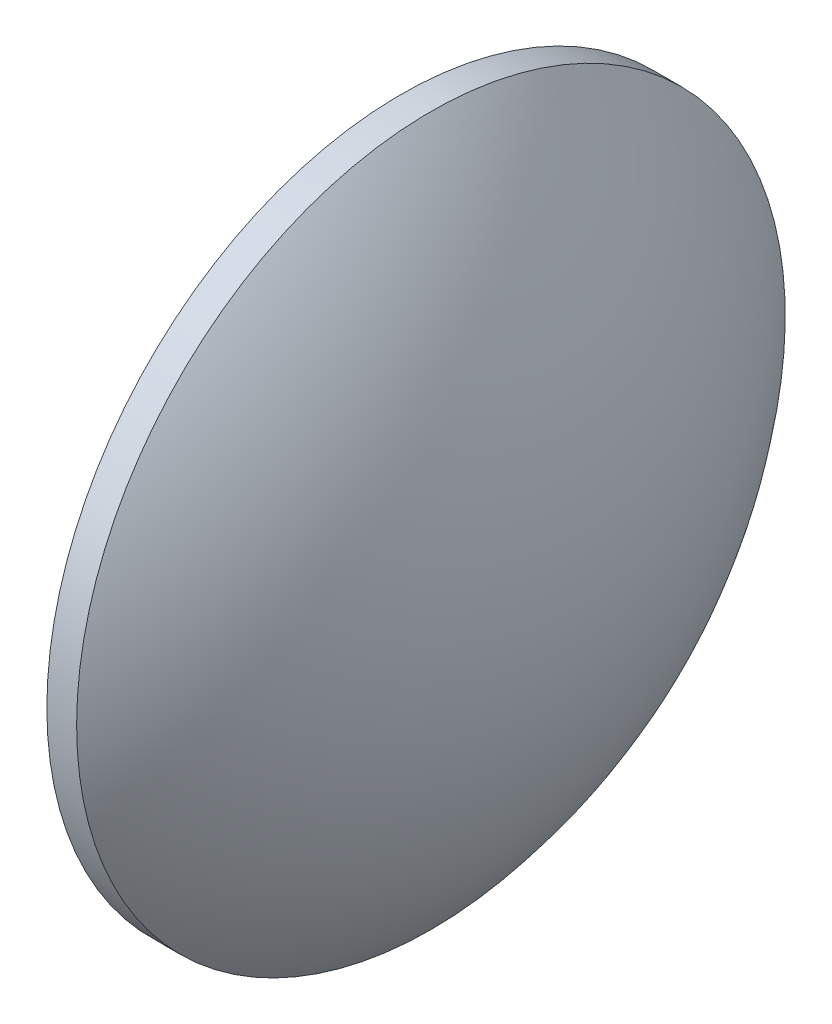
ISO-10303-21;
HEADER;
FILE_DESCRIPTION(('STEP AP214'),'2;1');
FILE_NAME('part.step','',(''),(''),'','','');
FILE_SCHEMA(('AUTOMOTIVE_DESIGN { 1 0 10303 214 1 1 1 1 }'));
ENDSEC;
DATA;
#1=APPLICATION_CONTEXT('core data for automotive mechanical design processes');
#2=APPLICATION_PROTOCOL_DEFINITION('international standard','automotive_design',2000,#1);
#3=PRODUCT_CONTEXT('',#1,'mechanical');
#4=PRODUCT('Part','Part','',(#3));
#5=PRODUCT_RELATED_PRODUCT_CATEGORY('part','',(#4));
#6=PRODUCT_DEFINITION_FORMATION('','',#4);
#7=PRODUCT_DEFINITION_CONTEXT('part definition',#1,'design');
#8=PRODUCT_DEFINITION('design','',#6,#7);
#9=PRODUCT_DEFINITION_SHAPE('','',#8);
#10=(LENGTH_UNIT() NAMED_UNIT(*) SI_UNIT(.MILLI.,.METRE.));
#11=(NAMED_UNIT(*) PLANE_ANGLE_UNIT() SI_UNIT($,.RADIAN.));
#12=(NAMED_UNIT(*) SI_UNIT($,.STERADIAN.) SOLID_ANGLE_UNIT());
#13=UNCERTAINTY_MEASURE_WITH_UNIT(LENGTH_MEASURE(1.E-05),#10,'distance_accuracy_value','');
#14=(GEOMETRIC_REPRESENTATION_CONTEXT(3) GLOBAL_UNCERTAINTY_ASSIGNED_CONTEXT((#13)) GLOBAL_UNIT_ASSIGNED_CONTEXT((#10,
#11,#12)) REPRESENTATION_CONTEXT('',''));
#15=CARTESIAN_POINT('',(0.,0.,0.));
#16=DIRECTION('',(0.,0.,1.));
#17=DIRECTION('',(1.,0.,0.));
#18=AXIS2_PLACEMENT_3D('',#15,#16,#17);
#19=CARTESIAN_POINT('',(430.528705652168,82.5986387398712,0.));
#20=DIRECTION('',(-1.,0.,0.));
#21=DIRECTION('',(0.,-1.,0.));
#22=AXIS2_PLACEMENT_3D('',#19,#20,#21);
#23=SPHERICAL_SURFACE('',#22,15.4912021857924);
#24=CARTESIAN_POINT('',(442.35990783796,82.5986387398711,0.));
#25=DIRECTION('',(-1.,0.,0.));
#26=DIRECTION('',(0.,0.,1.));
#27=AXIS2_PLACEMENT_3D('',#24,#25,#26);
#28=CIRCLE('',#27,9.99999999999999);
#29=CARTESIAN_POINT('',(442.35990783796,82.5986387398711,9.99999999999999));
#30=VERTEX_POINT('',#29);
#31=EDGE_CURVE('E10',#30,#30,#28,.T.);
#32=ORIENTED_EDGE('',*,*,#31,.F.);
#33=EDGE_LOOP('',(#32));
#34=FACE_BOUND('',#33,.T.);
#35=ADVANCED_FACE('F35',(#34),#23,.T.);
#36=CARTESIAN_POINT('',(439.89662177521,82.5986387398711,0.));
#37=DIRECTION('',(-1.,0.,0.));
#38=DIRECTION('',(0.,0.,1.));
#39=AXIS2_PLACEMENT_3D('',#36,#37,#38);
#40=CYLINDRICAL_SURFACE('',#39,9.99999999999999);
#41=CARTESIAN_POINT('',(441.51990783796,82.5986387398711,0.));
#42=DIRECTION('',(-1.,0.,0.));
#43=DIRECTION('',(0.,0.,1.));
#44=AXIS2_PLACEMENT_3D('',#41,#42,#43);
#45=CIRCLE('',#44,9.99999999999999);
#46=CARTESIAN_POINT('',(441.51990783796,82.5986387398711,9.99999999999999));
#47=VERTEX_POINT('',#46);
#48=EDGE_CURVE('E41',#47,#47,#45,.T.);
#49=ORIENTED_EDGE('',*,*,#48,.F.);
#50=EDGE_LOOP('',(#49));
#51=FACE_BOUND('',#50,.T.);
#52=ORIENTED_EDGE('',*,*,#31,.T.);
#53=EDGE_LOOP('',(#52));
#54=FACE_BOUND('',#53,.T.);
#55=ADVANCED_FACE('F49',(#51,#54),#40,.T.);
#56=CARTESIAN_POINT('',(441.51990783796,82.5986387398711,0.));
#57=DIRECTION('',(1.,0.,0.));
#58=DIRECTION('',(0.,0.,-1.));
#59=AXIS2_PLACEMENT_3D('',#56,#57,#58);
#60=PLANE('',#59);
#61=ORIENTED_EDGE('',*,*,#48,.T.);
#62=EDGE_LOOP('',(#61));
#63=FACE_BOUND('',#62,.T.);
#64=ADVANCED_FACE('F47',(#63),#60,.F.);
#65=CLOSED_SHELL('',(#35,#55,#64));
#66=MANIFOLD_SOLID_BREP('B2',#65);
#67=ADVANCED_BREP_SHAPE_REPRESENTATION('',(#18,#66),#14);
#68=SHAPE_DEFINITION_REPRESENTATION(#9,#67);
ENDSEC;
END-ISO-10303-21;
